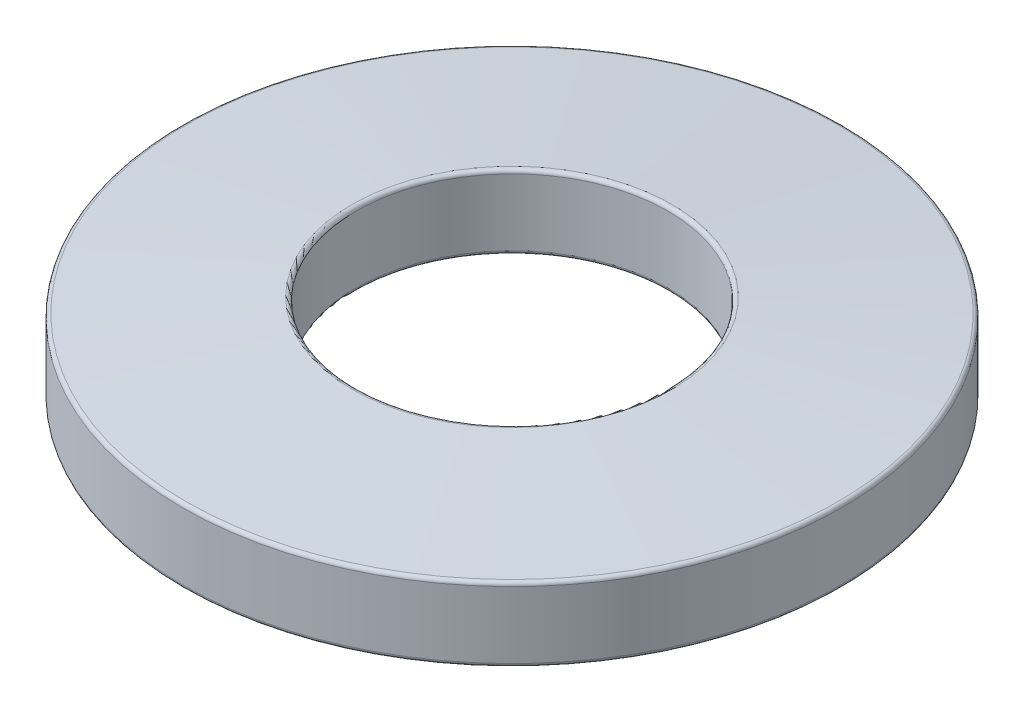
ISO-10303-21;
HEADER;
FILE_DESCRIPTION(('STEP AP214'),'2;1');
FILE_NAME('part.step','',(''),(''),'','','');
FILE_SCHEMA(('AUTOMOTIVE_DESIGN { 1 0 10303 214 1 1 1 1 }'));
ENDSEC;
DATA;
#1=APPLICATION_CONTEXT('core data for automotive mechanical design processes');
#2=APPLICATION_PROTOCOL_DEFINITION('international standard','automotive_design',2000,#1);
#3=PRODUCT_CONTEXT('',#1,'mechanical');
#4=PRODUCT('Part','Part','',(#3));
#5=PRODUCT_RELATED_PRODUCT_CATEGORY('part','',(#4));
#6=PRODUCT_DEFINITION_FORMATION('','',#4);
#7=PRODUCT_DEFINITION_CONTEXT('part definition',#1,'design');
#8=PRODUCT_DEFINITION('design','',#6,#7);
#9=PRODUCT_DEFINITION_SHAPE('','',#8);
#10=(LENGTH_UNIT() NAMED_UNIT(*) SI_UNIT(.MILLI.,.METRE.));
#11=(NAMED_UNIT(*) PLANE_ANGLE_UNIT() SI_UNIT($,.RADIAN.));
#12=(NAMED_UNIT(*) SI_UNIT($,.STERADIAN.) SOLID_ANGLE_UNIT());
#13=UNCERTAINTY_MEASURE_WITH_UNIT(LENGTH_MEASURE(1.E-05),#10,'distance_accuracy_value','');
#14=(GEOMETRIC_REPRESENTATION_CONTEXT(3) GLOBAL_UNCERTAINTY_ASSIGNED_CONTEXT((#13)) GLOBAL_UNIT_ASSIGNED_CONTEXT((#10,
#11,#12)) REPRESENTATION_CONTEXT('',''));
#15=CARTESIAN_POINT('',(0.,0.,0.));
#16=DIRECTION('',(0.,0.,1.));
#17=DIRECTION('',(1.,0.,0.));
#18=AXIS2_PLACEMENT_3D('',#15,#16,#17);
#19=CARTESIAN_POINT('',(0.,5.0292,0.));
#20=DIRECTION('',(0.,-1.,0.));
#21=DIRECTION('',(0.,0.,-1.));
#22=AXIS2_PLACEMENT_3D('',#19,#20,#21);
#23=CONICAL_SURFACE('',#22,22.352,1.4857805991996);
#24=CARTESIAN_POINT('',(0.,5.04900812151732,0.));
#25=DIRECTION('',(0.,1.,0.));
#26=DIRECTION('',(0.,0.,1.));
#27=AXIS2_PLACEMENT_3D('',#24,#25,#26);
#28=CIRCLE('',#27,22.1195679918158);
#29=CARTESIAN_POINT('',(0.,5.04900812151732,22.1195679918158));
#30=VERTEX_POINT('',#29);
#31=EDGE_CURVE('E48',#30,#30,#28,.T.);
#32=ORIENTED_EDGE('',*,*,#31,.T.);
#33=EDGE_LOOP('',(#32));
#34=FACE_BOUND('',#33,.T.);
#35=CARTESIAN_POINT('',(0.,6.00901578063274,0.));
#36=DIRECTION('',(0.,1.,0.));
#37=DIRECTION('',(0.,0.,1.));
#38=AXIS2_PLACEMENT_3D('',#35,#36,#37);
#39=CIRCLE('',#38,10.8546679918158);
#40=CARTESIAN_POINT('',(0.,6.00901578063274,10.8546679918158));
#41=VERTEX_POINT('',#40);
#42=EDGE_CURVE('E52',#41,#41,#39,.F.);
#43=ORIENTED_EDGE('',*,*,#42,.T.);
#44=EDGE_LOOP('',(#43));
#45=FACE_BOUND('',#44,.T.);
#46=ADVANCED_FACE('F37',(#34,#45),#23,.T.);
#47=CARTESIAN_POINT('',(0.,0.,0.));
#48=DIRECTION('',(0.,-1.,0.));
#49=DIRECTION('',(0.,0.,-1.));
#50=AXIS2_PLACEMENT_3D('',#47,#48,#49);
#51=CYLINDRICAL_SURFACE('',#50,10.5791);
#52=CARTESIAN_POINT('',(0.,1.23657451662492,0.));
#53=DIRECTION('',(0.,1.,0.));
#54=DIRECTION('',(0.,0.,1.));
#55=AXIS2_PLACEMENT_3D('',#52,#53,#54);
#56=CIRCLE('',#55,10.5791);
#57=CARTESIAN_POINT('',(0.,1.23657451662492,10.5791));
#58=VERTEX_POINT('',#57);
#59=EDGE_CURVE('E10',#58,#58,#56,.F.);
#60=ORIENTED_EDGE('',*,*,#59,.T.);
#61=EDGE_LOOP('',(#60));
#62=FACE_BOUND('',#61,.T.);
#63=CARTESIAN_POINT('',(0.,5.75593314249051,0.));
#64=DIRECTION('',(0.,1.,0.));
#65=DIRECTION('',(0.,0.,1.));
#66=AXIS2_PLACEMENT_3D('',#63,#64,#65);
#67=CIRCLE('',#66,10.5791);
#68=CARTESIAN_POINT('',(0.,5.75593314249051,10.5791));
#69=VERTEX_POINT('',#68);
#70=EDGE_CURVE('E44',#69,#69,#67,.T.);
#71=ORIENTED_EDGE('',*,*,#70,.T.);
#72=EDGE_LOOP('',(#71));
#73=FACE_BOUND('',#72,.T.);
#74=ADVANCED_FACE('F85',(#62,#73),#51,.F.);
#75=CARTESIAN_POINT('',(0.,1.0033,0.));
#76=DIRECTION('',(0.,-1.,0.));
#77=DIRECTION('',(0.,0.,-1.));
#78=AXIS2_PLACEMENT_3D('',#75,#76,#77);
#79=CONICAL_SURFACE('',#78,10.5791,1.4857805991996);
#80=CARTESIAN_POINT('',(0.,0.0234842193672562,0.));
#81=DIRECTION('',(0.,1.,0.));
#82=DIRECTION('',(0.,0.,1.));
#83=AXIS2_PLACEMENT_3D('',#80,#81,#82);
#84=CIRCLE('',#83,22.0764320081842);
#85=CARTESIAN_POINT('',(0.,0.0234842193672562,22.0764320081842));
#86=VERTEX_POINT('',#85);
#87=EDGE_CURVE('E63',#86,#86,#84,.F.);
#88=ORIENTED_EDGE('',*,*,#87,.T.);
#89=EDGE_LOOP('',(#88));
#90=FACE_BOUND('',#89,.T.);
#91=CARTESIAN_POINT('',(0.,0.983491878482682,0.));
#92=DIRECTION('',(0.,1.,0.));
#93=DIRECTION('',(0.,0.,1.));
#94=AXIS2_PLACEMENT_3D('',#91,#92,#93);
#95=CIRCLE('',#94,10.8115320081842);
#96=CARTESIAN_POINT('',(0.,0.983491878482682,10.8115320081842));
#97=VERTEX_POINT('',#96);
#98=EDGE_CURVE('E66',#97,#97,#95,.T.);
#99=ORIENTED_EDGE('',*,*,#98,.T.);
#100=EDGE_LOOP('',(#99));
#101=FACE_BOUND('',#100,.T.);
#102=ADVANCED_FACE('F70',(#90,#101),#79,.F.);
#103=CARTESIAN_POINT('',(0.,0.,0.));
#104=DIRECTION('',(0.,-1.,0.));
#105=DIRECTION('',(0.,0.,-1.));
#106=AXIS2_PLACEMENT_3D('',#103,#104,#105);
#107=CYLINDRICAL_SURFACE('',#106,22.352);
#108=CARTESIAN_POINT('',(0.,0.276566857509492,0.));
#109=DIRECTION('',(0.,1.,0.));
#110=DIRECTION('',(0.,0.,1.));
#111=AXIS2_PLACEMENT_3D('',#108,#109,#110);
#112=CIRCLE('',#111,22.352);
#113=CARTESIAN_POINT('',(0.,0.276566857509492,22.352));
#114=VERTEX_POINT('',#113);
#115=EDGE_CURVE('E57',#114,#114,#112,.T.);
#116=ORIENTED_EDGE('',*,*,#115,.T.);
#117=EDGE_LOOP('',(#116));
#118=FACE_BOUND('',#117,.T.);
#119=CARTESIAN_POINT('',(0.,4.79592548337508,0.));
#120=DIRECTION('',(0.,1.,0.));
#121=DIRECTION('',(0.,0.,1.));
#122=AXIS2_PLACEMENT_3D('',#119,#120,#121);
#123=CIRCLE('',#122,22.352);
#124=CARTESIAN_POINT('',(0.,4.79592548337508,22.352));
#125=VERTEX_POINT('',#124);
#126=EDGE_CURVE('E60',#125,#125,#123,.F.);
#127=ORIENTED_EDGE('',*,*,#126,.T.);
#128=EDGE_LOOP('',(#127));
#129=FACE_BOUND('',#128,.T.);
#130=ADVANCED_FACE('F96',(#118,#129),#107,.T.);
#131=CARTESIAN_POINT('',(0.,0.276566857509492,0.));
#132=DIRECTION('',(0.,1.,0.));
#133=DIRECTION('',(0.,0.,1.));
#134=AXIS2_PLACEMENT_3D('',#131,#132,#133);
#135=TOROIDAL_SURFACE('',#134,22.098,0.254);
#136=ORIENTED_EDGE('',*,*,#115,.F.);
#137=EDGE_LOOP('',(#136));
#138=FACE_BOUND('',#137,.T.);
#139=ORIENTED_EDGE('',*,*,#87,.F.);
#140=EDGE_LOOP('',(#139));
#141=FACE_BOUND('',#140,.T.);
#142=ADVANCED_FACE('F81',(#138,#141),#135,.T.);
#143=CARTESIAN_POINT('',(0.,4.79592548337508,0.));
#144=DIRECTION('',(0.,1.,0.));
#145=DIRECTION('',(0.,0.,1.));
#146=AXIS2_PLACEMENT_3D('',#143,#144,#145);
#147=TOROIDAL_SURFACE('',#146,22.098,0.254);
#148=ORIENTED_EDGE('',*,*,#31,.F.);
#149=EDGE_LOOP('',(#148));
#150=FACE_BOUND('',#149,.T.);
#151=ORIENTED_EDGE('',*,*,#126,.F.);
#152=EDGE_LOOP('',(#151));
#153=FACE_BOUND('',#152,.T.);
#154=ADVANCED_FACE('F75',(#150,#153),#147,.T.);
#155=CARTESIAN_POINT('',(0.,1.23657451662492,0.));
#156=DIRECTION('',(0.,1.,0.));
#157=DIRECTION('',(0.,0.,1.));
#158=AXIS2_PLACEMENT_3D('',#155,#156,#157);
#159=TOROIDAL_SURFACE('',#158,10.8331,0.254);
#160=ORIENTED_EDGE('',*,*,#98,.F.);
#161=EDGE_LOOP('',(#160));
#162=FACE_BOUND('',#161,.T.);
#163=ORIENTED_EDGE('',*,*,#59,.F.);
#164=EDGE_LOOP('',(#163));
#165=FACE_BOUND('',#164,.T.);
#166=ADVANCED_FACE('F72',(#162,#165),#159,.T.);
#167=CARTESIAN_POINT('',(0.,5.75593314249051,0.));
#168=DIRECTION('',(0.,1.,0.));
#169=DIRECTION('',(0.,0.,1.));
#170=AXIS2_PLACEMENT_3D('',#167,#168,#169);
#171=TOROIDAL_SURFACE('',#170,10.8331,0.254);
#172=ORIENTED_EDGE('',*,*,#70,.F.);
#173=EDGE_LOOP('',(#172));
#174=FACE_BOUND('',#173,.T.);
#175=ORIENTED_EDGE('',*,*,#42,.F.);
#176=EDGE_LOOP('',(#175));
#177=FACE_BOUND('',#176,.T.);
#178=ADVANCED_FACE('F39',(#174,#177),#171,.T.);
#179=CLOSED_SHELL('',(#46,#74,#102,#130,#142,#154,#166,#178));
#180=MANIFOLD_SOLID_BREP('B2',#179);
#181=ADVANCED_BREP_SHAPE_REPRESENTATION('',(#18,#180),#14);
#182=SHAPE_DEFINITION_REPRESENTATION(#9,#181);
ENDSEC;
END-ISO-10303-21;
